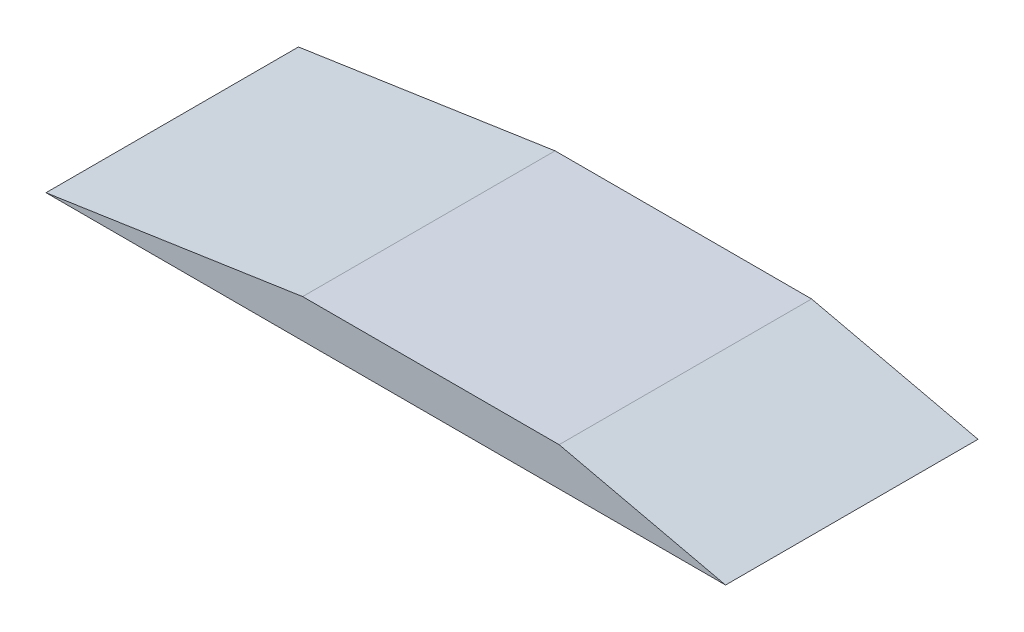
ISO-10303-21;
HEADER;
FILE_DESCRIPTION(('STEP AP214'),'2;1');
FILE_NAME('part.step','',(''),(''),'','','');
FILE_SCHEMA(('AUTOMOTIVE_DESIGN { 1 0 10303 214 1 1 1 1 }'));
ENDSEC;
DATA;
#1=APPLICATION_CONTEXT('core data for automotive mechanical design processes');
#2=APPLICATION_PROTOCOL_DEFINITION('international standard','automotive_design',2000,#1);
#3=PRODUCT_CONTEXT('',#1,'mechanical');
#4=PRODUCT('Part','Part','',(#3));
#5=PRODUCT_RELATED_PRODUCT_CATEGORY('part','',(#4));
#6=PRODUCT_DEFINITION_FORMATION('','',#4);
#7=PRODUCT_DEFINITION_CONTEXT('part definition',#1,'design');
#8=PRODUCT_DEFINITION('design','',#6,#7);
#9=PRODUCT_DEFINITION_SHAPE('','',#8);
#10=(LENGTH_UNIT() NAMED_UNIT(*) SI_UNIT(.MILLI.,.METRE.));
#11=(NAMED_UNIT(*) PLANE_ANGLE_UNIT() SI_UNIT($,.RADIAN.));
#12=(NAMED_UNIT(*) SI_UNIT($,.STERADIAN.) SOLID_ANGLE_UNIT());
#13=UNCERTAINTY_MEASURE_WITH_UNIT(LENGTH_MEASURE(1.E-05),#10,'distance_accuracy_value','');
#14=(GEOMETRIC_REPRESENTATION_CONTEXT(3) GLOBAL_UNCERTAINTY_ASSIGNED_CONTEXT((#13)) GLOBAL_UNIT_ASSIGNED_CONTEXT((#10,
#11,#12)) REPRESENTATION_CONTEXT('',''));
#15=CARTESIAN_POINT('',(0.,0.,0.));
#16=DIRECTION('',(0.,0.,1.));
#17=DIRECTION('',(1.,0.,0.));
#18=AXIS2_PLACEMENT_3D('',#15,#16,#17);
#19=CARTESIAN_POINT('',(-95.0002361007004,-47.2483624148231,500.));
#20=DIRECTION('',(-0.147778739784775,0.989020446738905,0.));
#21=DIRECTION('',(-0.989020446738905,-0.147778739784775,0.));
#22=AXIS2_PLACEMENT_3D('',#19,#20,#21);
#23=PLANE('',#22);
#24=DIRECTION('',(0.989020446738905,0.147778739784775,0.));
#25=VECTOR('',#24,1.);
#26=CARTESIAN_POINT('',(-95.0002361007004,-47.2483624148231,0.));
#27=LINE('',#26,#25);
#28=CARTESIAN_POINT('',(-95.0002361007004,-47.2483624148231,0.));
#29=VERTEX_POINT('',#28);
#30=CARTESIAN_POINT('',(413.295633513102,28.7008490468931,0.));
#31=VERTEX_POINT('',#30);
#32=EDGE_CURVE('E108',#29,#31,#27,.T.);
#33=ORIENTED_EDGE('',*,*,#32,.F.);
#34=DIRECTION('',(0.,0.,-1.));
#35=VECTOR('',#34,1.);
#36=CARTESIAN_POINT('',(-95.0002361007004,-47.2483624148231,500.));
#37=LINE('',#36,#35);
#38=CARTESIAN_POINT('',(-95.0002361007004,-47.2483624148231,500.));
#39=VERTEX_POINT('',#38);
#40=EDGE_CURVE('E11',#39,#29,#37,.T.);
#41=ORIENTED_EDGE('',*,*,#40,.F.);
#42=DIRECTION('',(0.989020446738905,0.147778739784775,0.));
#43=VECTOR('',#42,1.);
#44=CARTESIAN_POINT('',(-95.0002361007004,-47.2483624148231,500.));
#45=LINE('',#44,#43);
#46=CARTESIAN_POINT('',(413.295633513102,28.7008490468931,500.));
#47=VERTEX_POINT('',#46);
#48=EDGE_CURVE('E101',#39,#47,#45,.T.);
#49=ORIENTED_EDGE('',*,*,#48,.T.);
#50=DIRECTION('',(0.,0.,-1.));
#51=VECTOR('',#50,1.);
#52=CARTESIAN_POINT('',(413.295633513102,28.7008490468931,500.));
#53=LINE('',#52,#51);
#54=EDGE_CURVE('E42',#47,#31,#53,.T.);
#55=ORIENTED_EDGE('',*,*,#54,.T.);
#56=EDGE_LOOP('',(#33,#41,#49,#55));
#57=FACE_BOUND('',#56,.T.);
#58=ADVANCED_FACE('F39',(#57),#23,.T.);
#59=CARTESIAN_POINT('',(-95.0002361007004,-47.2483624148231,500.));
#60=DIRECTION('',(0.,1.,0.));
#61=DIRECTION('',(0.,0.,1.));
#62=AXIS2_PLACEMENT_3D('',#59,#60,#61);
#63=PLANE('',#62);
#64=DIRECTION('',(1.,0.,0.));
#65=VECTOR('',#64,1.);
#66=CARTESIAN_POINT('',(-95.0002361007004,-47.2483624148231,0.));
#67=LINE('',#66,#65);
#68=CARTESIAN_POINT('',(1250.95934976706,-47.2483624148231,0.));
#69=VERTEX_POINT('',#68);
#70=EDGE_CURVE('E71',#29,#69,#67,.T.);
#71=ORIENTED_EDGE('',*,*,#70,.T.);
#72=DIRECTION('',(0.,0.,-1.));
#73=VECTOR('',#72,1.);
#74=CARTESIAN_POINT('',(1250.95934976706,-47.2483624148231,500.));
#75=LINE('',#74,#73);
#76=CARTESIAN_POINT('',(1250.95934976706,-47.2483624148231,500.));
#77=VERTEX_POINT('',#76);
#78=EDGE_CURVE('E49',#77,#69,#75,.T.);
#79=ORIENTED_EDGE('',*,*,#78,.F.);
#80=DIRECTION('',(-1.,0.,0.));
#81=VECTOR('',#80,1.);
#82=CARTESIAN_POINT('',(1250.95934976706,-47.2483624148231,500.));
#83=LINE('',#82,#81);
#84=EDGE_CURVE('E57',#77,#39,#83,.T.);
#85=ORIENTED_EDGE('',*,*,#84,.T.);
#86=ORIENTED_EDGE('',*,*,#40,.T.);
#87=EDGE_LOOP('',(#71,#79,#85,#86));
#88=FACE_BOUND('',#87,.T.);
#89=ADVANCED_FACE('F126',(#88),#63,.F.);
#90=CARTESIAN_POINT('',(921.313099910586,28.7008490468931,500.));
#91=DIRECTION('',(0.22451427520147,0.974470800091393,0.));
#92=DIRECTION('',(-0.974470800091392,0.22451427520147,0.));
#93=AXIS2_PLACEMENT_3D('',#90,#91,#92);
#94=PLANE('',#93);
#95=DIRECTION('',(0.974470800091392,-0.22451427520147,0.));
#96=VECTOR('',#95,1.);
#97=CARTESIAN_POINT('',(921.313099910586,28.7008490468931,0.));
#98=LINE('',#97,#96);
#99=CARTESIAN_POINT('',(921.313099910586,28.7008490468931,0.));
#100=VERTEX_POINT('',#99);
#101=EDGE_CURVE('E89',#100,#69,#98,.T.);
#102=ORIENTED_EDGE('',*,*,#101,.F.);
#103=DIRECTION('',(0.,0.,-1.));
#104=VECTOR('',#103,1.);
#105=CARTESIAN_POINT('',(921.313099910586,28.7008490468931,500.));
#106=LINE('',#105,#104);
#107=CARTESIAN_POINT('',(921.313099910586,28.7008490468931,500.));
#108=VERTEX_POINT('',#107);
#109=EDGE_CURVE('E84',#108,#100,#106,.T.);
#110=ORIENTED_EDGE('',*,*,#109,.F.);
#111=DIRECTION('',(0.974470800091392,-0.22451427520147,0.));
#112=VECTOR('',#111,1.);
#113=CARTESIAN_POINT('',(921.313099910586,28.7008490468931,500.));
#114=LINE('',#113,#112);
#115=EDGE_CURVE('E87',#108,#77,#114,.T.);
#116=ORIENTED_EDGE('',*,*,#115,.T.);
#117=ORIENTED_EDGE('',*,*,#78,.T.);
#118=EDGE_LOOP('',(#102,#110,#116,#117));
#119=FACE_BOUND('',#118,.T.);
#120=ADVANCED_FACE('F86',(#119),#94,.T.);
#121=CARTESIAN_POINT('',(413.295633513102,28.7008490468931,500.));
#122=DIRECTION('',(0.,1.,0.));
#123=DIRECTION('',(0.,0.,1.));
#124=AXIS2_PLACEMENT_3D('',#121,#122,#123);
#125=PLANE('',#124);
#126=DIRECTION('',(1.,0.,0.));
#127=VECTOR('',#126,1.);
#128=CARTESIAN_POINT('',(413.295633513102,28.7008490468931,0.));
#129=LINE('',#128,#127);
#130=EDGE_CURVE('E112',#31,#100,#129,.T.);
#131=ORIENTED_EDGE('',*,*,#130,.F.);
#132=ORIENTED_EDGE('',*,*,#54,.F.);
#133=DIRECTION('',(1.,0.,0.));
#134=VECTOR('',#133,1.);
#135=CARTESIAN_POINT('',(413.295633513102,28.7008490468931,500.));
#136=LINE('',#135,#134);
#137=EDGE_CURVE('E95',#47,#108,#136,.T.);
#138=ORIENTED_EDGE('',*,*,#137,.T.);
#139=ORIENTED_EDGE('',*,*,#109,.T.);
#140=EDGE_LOOP('',(#131,#132,#138,#139));
#141=FACE_BOUND('',#140,.T.);
#142=ADVANCED_FACE('F99',(#141),#125,.T.);
#143=CARTESIAN_POINT('',(0.,0.,500.));
#144=DIRECTION('',(0.,0.,-1.));
#145=DIRECTION('',(-1.,0.,0.));
#146=AXIS2_PLACEMENT_3D('',#143,#144,#145);
#147=PLANE('',#146);
#148=ORIENTED_EDGE('',*,*,#48,.F.);
#149=ORIENTED_EDGE('',*,*,#84,.F.);
#150=ORIENTED_EDGE('',*,*,#115,.F.);
#151=ORIENTED_EDGE('',*,*,#137,.F.);
#152=EDGE_LOOP('',(#148,#149,#150,#151));
#153=FACE_BOUND('',#152,.T.);
#154=ADVANCED_FACE('F94',(#153),#147,.F.);
#155=CARTESIAN_POINT('',(0.,0.,0.));
#156=DIRECTION('',(0.,0.,-1.));
#157=DIRECTION('',(-1.,0.,0.));
#158=AXIS2_PLACEMENT_3D('',#155,#156,#157);
#159=PLANE('',#158);
#160=ORIENTED_EDGE('',*,*,#32,.T.);
#161=ORIENTED_EDGE('',*,*,#130,.T.);
#162=ORIENTED_EDGE('',*,*,#101,.T.);
#163=ORIENTED_EDGE('',*,*,#70,.F.);
#164=EDGE_LOOP('',(#160,#161,#162,#163));
#165=FACE_BOUND('',#164,.T.);
#166=ADVANCED_FACE('F121',(#165),#159,.T.);
#167=CLOSED_SHELL('',(#58,#89,#120,#142,#154,#166));
#168=MANIFOLD_SOLID_BREP('B2',#167);
#169=ADVANCED_BREP_SHAPE_REPRESENTATION('',(#18,#168),#14);
#170=SHAPE_DEFINITION_REPRESENTATION(#9,#169);
ENDSEC;
END-ISO-10303-21;
